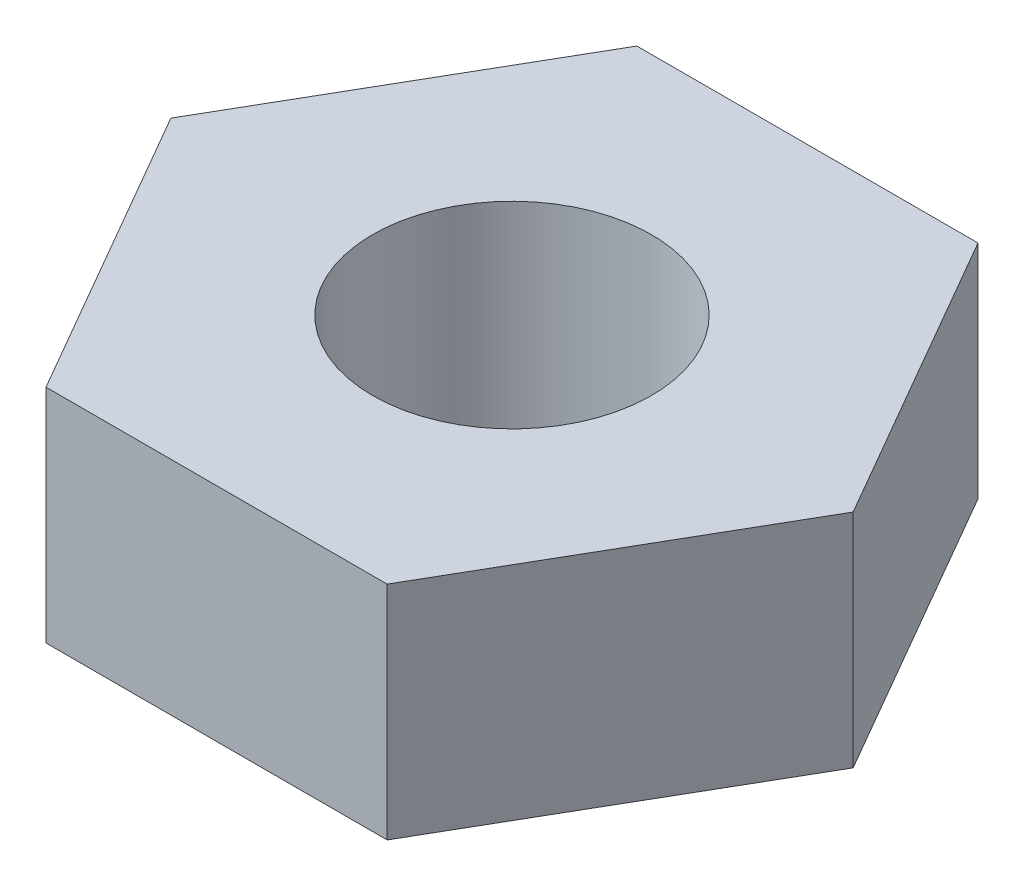
ISO-10303-21;
HEADER;
FILE_DESCRIPTION(('STEP AP214'),'2;1');
FILE_NAME('part.step','',(''),(''),'','','');
FILE_SCHEMA(('AUTOMOTIVE_DESIGN { 1 0 10303 214 1 1 1 1 }'));
ENDSEC;
DATA;
#1=APPLICATION_CONTEXT('core data for automotive mechanical design processes');
#2=APPLICATION_PROTOCOL_DEFINITION('international standard','automotive_design',2000,#1);
#3=PRODUCT_CONTEXT('',#1,'mechanical');
#4=PRODUCT('Part','Part','',(#3));
#5=PRODUCT_RELATED_PRODUCT_CATEGORY('part','',(#4));
#6=PRODUCT_DEFINITION_FORMATION('','',#4);
#7=PRODUCT_DEFINITION_CONTEXT('part definition',#1,'design');
#8=PRODUCT_DEFINITION('design','',#6,#7);
#9=PRODUCT_DEFINITION_SHAPE('','',#8);
#10=(LENGTH_UNIT() NAMED_UNIT(*) SI_UNIT(.MILLI.,.METRE.));
#11=(NAMED_UNIT(*) PLANE_ANGLE_UNIT() SI_UNIT($,.RADIAN.));
#12=(NAMED_UNIT(*) SI_UNIT($,.STERADIAN.) SOLID_ANGLE_UNIT());
#13=UNCERTAINTY_MEASURE_WITH_UNIT(LENGTH_MEASURE(1.E-05),#10,'distance_accuracy_value','');
#14=(GEOMETRIC_REPRESENTATION_CONTEXT(3) GLOBAL_UNCERTAINTY_ASSIGNED_CONTEXT((#13)) GLOBAL_UNIT_ASSIGNED_CONTEXT((#10,
#11,#12)) REPRESENTATION_CONTEXT('',''));
#15=CARTESIAN_POINT('',(0.,0.,0.));
#16=DIRECTION('',(0.,0.,1.));
#17=DIRECTION('',(1.,0.,0.));
#18=AXIS2_PLACEMENT_3D('',#15,#16,#17);
#19=CARTESIAN_POINT('',(1.83308710467706,2.38125,-3.175));
#20=DIRECTION('',(0.,1.,0.));
#21=DIRECTION('',(0.,0.,1.));
#22=AXIS2_PLACEMENT_3D('',#19,#20,#21);
#23=PLANE('',#22);
#24=DIRECTION('',(-0.5,0.,-0.866025403784438));
#25=VECTOR('',#24,1.);
#26=CARTESIAN_POINT('',(3.66617420935413,2.38125,0.));
#27=LINE('',#26,#25);
#28=CARTESIAN_POINT('',(3.66617420935413,2.38125,0.));
#29=VERTEX_POINT('',#28);
#30=CARTESIAN_POINT('',(1.83308710467706,2.38125,-3.175));
#31=VERTEX_POINT('',#30);
#32=EDGE_CURVE('E128',#29,#31,#27,.T.);
#33=ORIENTED_EDGE('',*,*,#32,.T.);
#34=DIRECTION('',(-1.,0.,0.));
#35=VECTOR('',#34,1.);
#36=CARTESIAN_POINT('',(1.83308710467706,2.38125,-3.175));
#37=LINE('',#36,#35);
#38=CARTESIAN_POINT('',(-1.83308710467706,2.38125,-3.175));
#39=VERTEX_POINT('',#38);
#40=EDGE_CURVE('E86',#31,#39,#37,.T.);
#41=ORIENTED_EDGE('',*,*,#40,.T.);
#42=DIRECTION('',(-0.5,0.,0.866025403784439));
#43=VECTOR('',#42,1.);
#44=CARTESIAN_POINT('',(-1.83308710467706,2.38125,-3.175));
#45=LINE('',#44,#43);
#46=CARTESIAN_POINT('',(-3.66617420935412,2.38125,0.));
#47=VERTEX_POINT('',#46);
#48=EDGE_CURVE('E99',#39,#47,#45,.T.);
#49=ORIENTED_EDGE('',*,*,#48,.T.);
#50=DIRECTION('',(0.5,0.,0.866025403784438));
#51=VECTOR('',#50,1.);
#52=CARTESIAN_POINT('',(-3.66617420935412,2.38125,0.));
#53=LINE('',#52,#51);
#54=CARTESIAN_POINT('',(-1.83308710467706,2.38125,3.175));
#55=VERTEX_POINT('',#54);
#56=EDGE_CURVE('E93',#47,#55,#53,.T.);
#57=ORIENTED_EDGE('',*,*,#56,.T.);
#58=DIRECTION('',(1.,0.,0.));
#59=VECTOR('',#58,1.);
#60=CARTESIAN_POINT('',(-1.83308710467706,2.38125,3.175));
#61=LINE('',#60,#59);
#62=CARTESIAN_POINT('',(1.83308710467706,2.38125,3.175));
#63=VERTEX_POINT('',#62);
#64=EDGE_CURVE('E97',#55,#63,#61,.T.);
#65=ORIENTED_EDGE('',*,*,#64,.T.);
#66=DIRECTION('',(0.5,0.,-0.866025403784438));
#67=VECTOR('',#66,1.);
#68=CARTESIAN_POINT('',(1.83308710467706,2.38125,3.175));
#69=LINE('',#68,#67);
#70=EDGE_CURVE('E49',#63,#29,#69,.T.);
#71=ORIENTED_EDGE('',*,*,#70,.T.);
#72=EDGE_LOOP('',(#33,#41,#49,#57,#65,#71));
#73=FACE_BOUND('',#72,.T.);
#74=CARTESIAN_POINT('',(0.,2.38125,0.));
#75=DIRECTION('',(0.,1.,0.));
#76=DIRECTION('',(0.,0.,1.));
#77=AXIS2_PLACEMENT_3D('',#74,#75,#76);
#78=CIRCLE('',#77,1.4986);
#79=CARTESIAN_POINT('',(0.,2.38125,1.4986));
#80=VERTEX_POINT('',#79);
#81=EDGE_CURVE('E121',#80,#80,#78,.T.);
#82=ORIENTED_EDGE('',*,*,#81,.F.);
#83=EDGE_LOOP('',(#82));
#84=FACE_BOUND('',#83,.T.);
#85=ADVANCED_FACE('F32',(#73,#84),#23,.T.);
#86=CARTESIAN_POINT('',(1.83308710467706,0.,-3.175));
#87=DIRECTION('',(0.,1.,0.));
#88=DIRECTION('',(0.,0.,1.));
#89=AXIS2_PLACEMENT_3D('',#86,#87,#88);
#90=PLANE('',#89);
#91=DIRECTION('',(-0.5,0.,-0.866025403784438));
#92=VECTOR('',#91,1.);
#93=CARTESIAN_POINT('',(3.66617420935413,0.,0.));
#94=LINE('',#93,#92);
#95=CARTESIAN_POINT('',(3.66617420935413,0.,0.));
#96=VERTEX_POINT('',#95);
#97=CARTESIAN_POINT('',(1.83308710467706,0.,-3.175));
#98=VERTEX_POINT('',#97);
#99=EDGE_CURVE('E117',#96,#98,#94,.T.);
#100=ORIENTED_EDGE('',*,*,#99,.F.);
#101=DIRECTION('',(0.5,0.,-0.866025403784438));
#102=VECTOR('',#101,1.);
#103=CARTESIAN_POINT('',(1.83308710467706,0.,3.175));
#104=LINE('',#103,#102);
#105=CARTESIAN_POINT('',(1.83308710467706,0.,3.175));
#106=VERTEX_POINT('',#105);
#107=EDGE_CURVE('E78',#106,#96,#104,.T.);
#108=ORIENTED_EDGE('',*,*,#107,.F.);
#109=DIRECTION('',(1.,0.,0.));
#110=VECTOR('',#109,1.);
#111=CARTESIAN_POINT('',(-1.83308710467706,0.,3.175));
#112=LINE('',#111,#110);
#113=CARTESIAN_POINT('',(-1.83308710467706,0.,3.175));
#114=VERTEX_POINT('',#113);
#115=EDGE_CURVE('E72',#114,#106,#112,.T.);
#116=ORIENTED_EDGE('',*,*,#115,.F.);
#117=DIRECTION('',(0.5,0.,0.866025403784438));
#118=VECTOR('',#117,1.);
#119=CARTESIAN_POINT('',(-3.66617420935412,0.,0.));
#120=LINE('',#119,#118);
#121=CARTESIAN_POINT('',(-3.66617420935412,0.,0.));
#122=VERTEX_POINT('',#121);
#123=EDGE_CURVE('E107',#122,#114,#120,.T.);
#124=ORIENTED_EDGE('',*,*,#123,.F.);
#125=DIRECTION('',(-0.5,0.,0.866025403784439));
#126=VECTOR('',#125,1.);
#127=CARTESIAN_POINT('',(-1.83308710467706,0.,-3.175));
#128=LINE('',#127,#126);
#129=CARTESIAN_POINT('',(-1.83308710467706,0.,-3.175));
#130=VERTEX_POINT('',#129);
#131=EDGE_CURVE('E123',#130,#122,#128,.T.);
#132=ORIENTED_EDGE('',*,*,#131,.F.);
#133=DIRECTION('',(-1.,0.,0.));
#134=VECTOR('',#133,1.);
#135=CARTESIAN_POINT('',(1.83308710467706,0.,-3.175));
#136=LINE('',#135,#134);
#137=EDGE_CURVE('E120',#98,#130,#136,.T.);
#138=ORIENTED_EDGE('',*,*,#137,.F.);
#139=EDGE_LOOP('',(#100,#108,#116,#124,#132,#138));
#140=FACE_BOUND('',#139,.T.);
#141=CARTESIAN_POINT('',(0.,0.,0.));
#142=DIRECTION('',(0.,1.,0.));
#143=DIRECTION('',(0.,0.,1.));
#144=AXIS2_PLACEMENT_3D('',#141,#142,#143);
#145=CIRCLE('',#144,1.4986);
#146=CARTESIAN_POINT('',(0.,0.,1.4986));
#147=VERTEX_POINT('',#146);
#148=EDGE_CURVE('E221',#147,#147,#145,.T.);
#149=ORIENTED_EDGE('',*,*,#148,.T.);
#150=EDGE_LOOP('',(#149));
#151=FACE_BOUND('',#150,.T.);
#152=ADVANCED_FACE('F137',(#140,#151),#90,.F.);
#153=CARTESIAN_POINT('',(3.66617420935413,2.38125,0.));
#154=DIRECTION('',(-0.866025403784438,0.,0.5));
#155=DIRECTION('',(0.5,0.,0.866025403784438));
#156=AXIS2_PLACEMENT_3D('',#153,#154,#155);
#157=PLANE('',#156);
#158=ORIENTED_EDGE('',*,*,#99,.T.);
#159=DIRECTION('',(0.,-1.,0.));
#160=VECTOR('',#159,1.);
#161=CARTESIAN_POINT('',(1.83308710467706,2.38125,-3.175));
#162=LINE('',#161,#160);
#163=EDGE_CURVE('E11',#31,#98,#162,.T.);
#164=ORIENTED_EDGE('',*,*,#163,.F.);
#165=ORIENTED_EDGE('',*,*,#32,.F.);
#166=DIRECTION('',(0.,-1.,0.));
#167=VECTOR('',#166,1.);
#168=CARTESIAN_POINT('',(3.66617420935413,2.38125,0.));
#169=LINE('',#168,#167);
#170=EDGE_CURVE('E113',#29,#96,#169,.T.);
#171=ORIENTED_EDGE('',*,*,#170,.T.);
#172=EDGE_LOOP('',(#158,#164,#165,#171));
#173=FACE_BOUND('',#172,.T.);
#174=ADVANCED_FACE('F34',(#173),#157,.F.);
#175=CARTESIAN_POINT('',(1.83308710467706,2.38125,-3.175));
#176=DIRECTION('',(0.,0.,1.));
#177=DIRECTION('',(1.,0.,0.));
#178=AXIS2_PLACEMENT_3D('',#175,#176,#177);
#179=PLANE('',#178);
#180=ORIENTED_EDGE('',*,*,#137,.T.);
#181=DIRECTION('',(0.,-1.,0.));
#182=VECTOR('',#181,1.);
#183=CARTESIAN_POINT('',(-1.83308710467706,2.38125,-3.175));
#184=LINE('',#183,#182);
#185=EDGE_CURVE('E41',#39,#130,#184,.T.);
#186=ORIENTED_EDGE('',*,*,#185,.F.);
#187=ORIENTED_EDGE('',*,*,#40,.F.);
#188=ORIENTED_EDGE('',*,*,#163,.T.);
#189=EDGE_LOOP('',(#180,#186,#187,#188));
#190=FACE_BOUND('',#189,.T.);
#191=ADVANCED_FACE('F162',(#190),#179,.F.);
#192=CARTESIAN_POINT('',(-1.83308710467706,2.38125,-3.175));
#193=DIRECTION('',(0.866025403784439,0.,0.5));
#194=DIRECTION('',(0.5,0.,-0.866025403784439));
#195=AXIS2_PLACEMENT_3D('',#192,#193,#194);
#196=PLANE('',#195);
#197=ORIENTED_EDGE('',*,*,#131,.T.);
#198=DIRECTION('',(0.,-1.,0.));
#199=VECTOR('',#198,1.);
#200=CARTESIAN_POINT('',(-3.66617420935412,2.38125,0.));
#201=LINE('',#200,#199);
#202=EDGE_CURVE('E108',#47,#122,#201,.T.);
#203=ORIENTED_EDGE('',*,*,#202,.F.);
#204=ORIENTED_EDGE('',*,*,#48,.F.);
#205=ORIENTED_EDGE('',*,*,#185,.T.);
#206=EDGE_LOOP('',(#197,#203,#204,#205));
#207=FACE_BOUND('',#206,.T.);
#208=ADVANCED_FACE('F134',(#207),#196,.F.);
#209=CARTESIAN_POINT('',(-3.66617420935412,2.38125,0.));
#210=DIRECTION('',(0.866025403784439,0.,-0.5));
#211=DIRECTION('',(-0.5,0.,-0.866025403784439));
#212=AXIS2_PLACEMENT_3D('',#209,#210,#211);
#213=PLANE('',#212);
#214=ORIENTED_EDGE('',*,*,#123,.T.);
#215=DIRECTION('',(0.,-1.,0.));
#216=VECTOR('',#215,1.);
#217=CARTESIAN_POINT('',(-1.83308710467706,2.38125,3.175));
#218=LINE('',#217,#216);
#219=EDGE_CURVE('E104',#55,#114,#218,.T.);
#220=ORIENTED_EDGE('',*,*,#219,.F.);
#221=ORIENTED_EDGE('',*,*,#56,.F.);
#222=ORIENTED_EDGE('',*,*,#202,.T.);
#223=EDGE_LOOP('',(#214,#220,#221,#222));
#224=FACE_BOUND('',#223,.T.);
#225=ADVANCED_FACE('F105',(#224),#213,.F.);
#226=CARTESIAN_POINT('',(-1.83308710467706,2.38125,3.175));
#227=DIRECTION('',(0.,0.,-1.));
#228=DIRECTION('',(-1.,0.,0.));
#229=AXIS2_PLACEMENT_3D('',#226,#227,#228);
#230=PLANE('',#229);
#231=ORIENTED_EDGE('',*,*,#115,.T.);
#232=DIRECTION('',(0.,-1.,0.));
#233=VECTOR('',#232,1.);
#234=CARTESIAN_POINT('',(1.83308710467706,2.38125,3.175));
#235=LINE('',#234,#233);
#236=EDGE_CURVE('E109',#63,#106,#235,.T.);
#237=ORIENTED_EDGE('',*,*,#236,.F.);
#238=ORIENTED_EDGE('',*,*,#64,.F.);
#239=ORIENTED_EDGE('',*,*,#219,.T.);
#240=EDGE_LOOP('',(#231,#237,#238,#239));
#241=FACE_BOUND('',#240,.T.);
#242=ADVANCED_FACE('F111',(#241),#230,.F.);
#243=CARTESIAN_POINT('',(1.83308710467706,2.38125,3.175));
#244=DIRECTION('',(-0.866025403784439,0.,-0.5));
#245=DIRECTION('',(-0.5,0.,0.866025403784439));
#246=AXIS2_PLACEMENT_3D('',#243,#244,#245);
#247=PLANE('',#246);
#248=ORIENTED_EDGE('',*,*,#107,.T.);
#249=ORIENTED_EDGE('',*,*,#170,.F.);
#250=ORIENTED_EDGE('',*,*,#70,.F.);
#251=ORIENTED_EDGE('',*,*,#236,.T.);
#252=EDGE_LOOP('',(#248,#249,#250,#251));
#253=FACE_BOUND('',#252,.T.);
#254=ADVANCED_FACE('F142',(#253),#247,.F.);
#255=CARTESIAN_POINT('',(0.,2.38125,0.));
#256=DIRECTION('',(0.,-1.,0.));
#257=DIRECTION('',(0.,0.,-1.));
#258=AXIS2_PLACEMENT_3D('',#255,#256,#257);
#259=CYLINDRICAL_SURFACE('',#258,1.4986);
#260=ORIENTED_EDGE('',*,*,#81,.T.);
#261=EDGE_LOOP('',(#260));
#262=FACE_BOUND('',#261,.T.);
#263=ORIENTED_EDGE('',*,*,#148,.F.);
#264=EDGE_LOOP('',(#263));
#265=FACE_BOUND('',#264,.T.);
#266=ADVANCED_FACE('F144',(#262,#265),#259,.F.);
#267=CLOSED_SHELL('',(#85,#152,#174,#191,#208,#225,#242,#254,#266));
#268=MANIFOLD_SOLID_BREP('B2',#267);
#269=ADVANCED_BREP_SHAPE_REPRESENTATION('',(#18,#268),#14);
#270=SHAPE_DEFINITION_REPRESENTATION(#9,#269);
ENDSEC;
END-ISO-10303-21;
